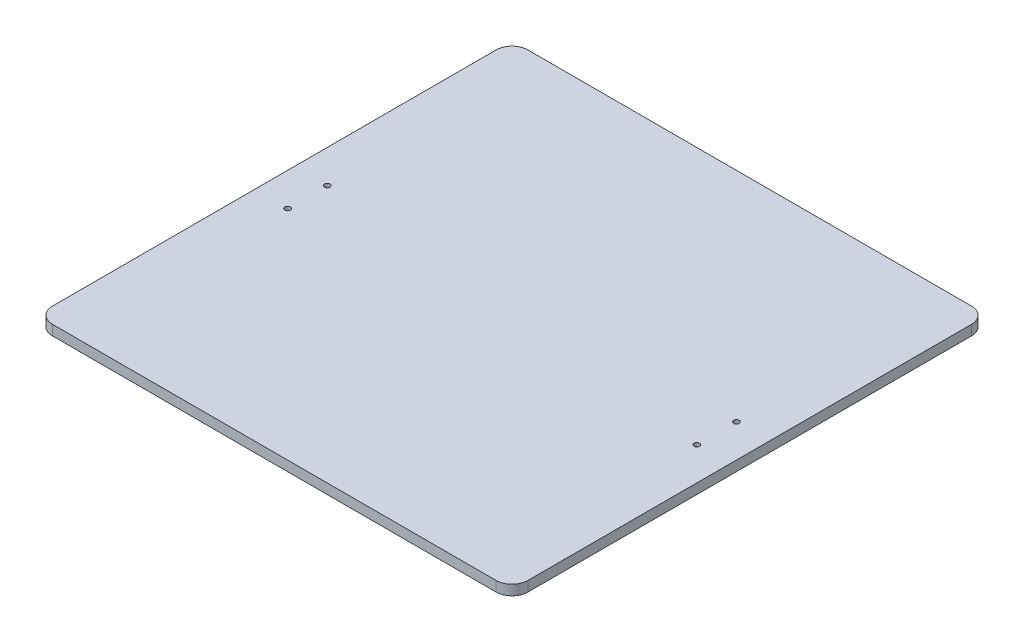
ISO-10303-21;
HEADER;
FILE_DESCRIPTION(('STEP AP214'),'2;1');
FILE_NAME('part.step','',(''),(''),'','','');
FILE_SCHEMA(('AUTOMOTIVE_DESIGN { 1 0 10303 214 1 1 1 1 }'));
ENDSEC;
DATA;
#1=APPLICATION_CONTEXT('core data for automotive mechanical design processes');
#2=APPLICATION_PROTOCOL_DEFINITION('international standard','automotive_design',2000,#1);
#3=PRODUCT_CONTEXT('',#1,'mechanical');
#4=PRODUCT('Part','Part','',(#3));
#5=PRODUCT_RELATED_PRODUCT_CATEGORY('part','',(#4));
#6=PRODUCT_DEFINITION_FORMATION('','',#4);
#7=PRODUCT_DEFINITION_CONTEXT('part definition',#1,'design');
#8=PRODUCT_DEFINITION('design','',#6,#7);
#9=PRODUCT_DEFINITION_SHAPE('','',#8);
#10=(LENGTH_UNIT() NAMED_UNIT(*) SI_UNIT(.MILLI.,.METRE.));
#11=(NAMED_UNIT(*) PLANE_ANGLE_UNIT() SI_UNIT($,.RADIAN.));
#12=(NAMED_UNIT(*) SI_UNIT($,.STERADIAN.) SOLID_ANGLE_UNIT());
#13=UNCERTAINTY_MEASURE_WITH_UNIT(LENGTH_MEASURE(1.E-05),#10,'distance_accuracy_value','');
#14=(GEOMETRIC_REPRESENTATION_CONTEXT(3) GLOBAL_UNCERTAINTY_ASSIGNED_CONTEXT((#13)) GLOBAL_UNIT_ASSIGNED_CONTEXT((#10,
#11,#12)) REPRESENTATION_CONTEXT('',''));
#15=CARTESIAN_POINT('',(0.,0.,0.));
#16=DIRECTION('',(0.,0.,1.));
#17=DIRECTION('',(1.,0.,0.));
#18=AXIS2_PLACEMENT_3D('',#15,#16,#17);
#19=CARTESIAN_POINT('',(150.,6.35,-150.));
#20=DIRECTION('',(-1.,0.,0.));
#21=DIRECTION('',(0.,0.,1.));
#22=AXIS2_PLACEMENT_3D('',#19,#20,#21);
#23=PLANE('',#22);
#24=DIRECTION('',(0.,0.,-1.));
#25=VECTOR('',#24,1.);
#26=CARTESIAN_POINT('',(150.,0.,-150.));
#27=LINE('',#26,#25);
#28=CARTESIAN_POINT('',(150.,0.,140.));
#29=VERTEX_POINT('',#28);
#30=CARTESIAN_POINT('',(150.,0.,-140.));
#31=VERTEX_POINT('',#30);
#32=EDGE_CURVE('E126',#29,#31,#27,.T.);
#33=ORIENTED_EDGE('',*,*,#32,.T.);
#34=DIRECTION('',(0.,-1.,0.));
#35=VECTOR('',#34,1.);
#36=CARTESIAN_POINT('',(150.,6.35,-140.));
#37=LINE('',#36,#35);
#38=CARTESIAN_POINT('',(150.,6.35,-140.));
#39=VERTEX_POINT('',#38);
#40=EDGE_CURVE('E104',#31,#39,#37,.F.);
#41=ORIENTED_EDGE('',*,*,#40,.T.);
#42=DIRECTION('',(0.,0.,-1.));
#43=VECTOR('',#42,1.);
#44=CARTESIAN_POINT('',(150.,6.35,-150.));
#45=LINE('',#44,#43);
#46=CARTESIAN_POINT('',(150.,6.35,140.));
#47=VERTEX_POINT('',#46);
#48=EDGE_CURVE('E136',#47,#39,#45,.T.);
#49=ORIENTED_EDGE('',*,*,#48,.F.);
#50=DIRECTION('',(0.,-1.,0.));
#51=VECTOR('',#50,1.);
#52=CARTESIAN_POINT('',(150.,6.35,140.));
#53=LINE('',#52,#51);
#54=EDGE_CURVE('E109',#47,#29,#53,.T.);
#55=ORIENTED_EDGE('',*,*,#54,.T.);
#56=EDGE_LOOP('',(#33,#41,#49,#55));
#57=FACE_BOUND('',#56,.T.);
#58=ADVANCED_FACE('F33',(#57),#23,.F.);
#59=CARTESIAN_POINT('',(-150.,6.35,-150.));
#60=DIRECTION('',(0.,0.,1.));
#61=DIRECTION('',(1.,0.,0.));
#62=AXIS2_PLACEMENT_3D('',#59,#60,#61);
#63=PLANE('',#62);
#64=DIRECTION('',(-1.,0.,0.));
#65=VECTOR('',#64,1.);
#66=CARTESIAN_POINT('',(-150.,6.35,-150.));
#67=LINE('',#66,#65);
#68=CARTESIAN_POINT('',(140.,6.35,-150.));
#69=VERTEX_POINT('',#68);
#70=CARTESIAN_POINT('',(-140.,6.35,-150.));
#71=VERTEX_POINT('',#70);
#72=EDGE_CURVE('E119',#69,#71,#67,.T.);
#73=ORIENTED_EDGE('',*,*,#72,.F.);
#74=DIRECTION('',(0.,-1.,0.));
#75=VECTOR('',#74,1.);
#76=CARTESIAN_POINT('',(140.,6.35,-150.));
#77=LINE('',#76,#75);
#78=CARTESIAN_POINT('',(140.,0.,-150.));
#79=VERTEX_POINT('',#78);
#80=EDGE_CURVE('E103',#69,#79,#77,.T.);
#81=ORIENTED_EDGE('',*,*,#80,.T.);
#82=DIRECTION('',(-1.,0.,0.));
#83=VECTOR('',#82,1.);
#84=CARTESIAN_POINT('',(-150.,0.,-150.));
#85=LINE('',#84,#83);
#86=CARTESIAN_POINT('',(-140.,0.,-150.));
#87=VERTEX_POINT('',#86);
#88=EDGE_CURVE('E116',#79,#87,#85,.T.);
#89=ORIENTED_EDGE('',*,*,#88,.T.);
#90=DIRECTION('',(0.,-1.,0.));
#91=VECTOR('',#90,1.);
#92=CARTESIAN_POINT('',(-140.,6.35,-150.));
#93=LINE('',#92,#91);
#94=EDGE_CURVE('E121',#87,#71,#93,.F.);
#95=ORIENTED_EDGE('',*,*,#94,.T.);
#96=EDGE_LOOP('',(#73,#81,#89,#95));
#97=FACE_BOUND('',#96,.T.);
#98=ADVANCED_FACE('F115',(#97),#63,.F.);
#99=CARTESIAN_POINT('',(-150.,6.35,-150.));
#100=DIRECTION('',(1.,0.,0.));
#101=DIRECTION('',(0.,0.,-1.));
#102=AXIS2_PLACEMENT_3D('',#99,#100,#101);
#103=PLANE('',#102);
#104=DIRECTION('',(0.,0.,1.));
#105=VECTOR('',#104,1.);
#106=CARTESIAN_POINT('',(-150.,0.,-150.));
#107=LINE('',#106,#105);
#108=CARTESIAN_POINT('',(-150.,0.,-140.));
#109=VERTEX_POINT('',#108);
#110=CARTESIAN_POINT('',(-150.,0.,140.));
#111=VERTEX_POINT('',#110);
#112=EDGE_CURVE('E125',#109,#111,#107,.T.);
#113=ORIENTED_EDGE('',*,*,#112,.T.);
#114=DIRECTION('',(0.,-1.,0.));
#115=VECTOR('',#114,1.);
#116=CARTESIAN_POINT('',(-150.,6.35,140.));
#117=LINE('',#116,#115);
#118=CARTESIAN_POINT('',(-150.,6.35,140.));
#119=VERTEX_POINT('',#118);
#120=EDGE_CURVE('E11',#111,#119,#117,.F.);
#121=ORIENTED_EDGE('',*,*,#120,.T.);
#122=DIRECTION('',(0.,0.,1.));
#123=VECTOR('',#122,1.);
#124=CARTESIAN_POINT('',(-150.,6.35,-150.));
#125=LINE('',#124,#123);
#126=CARTESIAN_POINT('',(-150.,6.35,-140.));
#127=VERTEX_POINT('',#126);
#128=EDGE_CURVE('E162',#127,#119,#125,.T.);
#129=ORIENTED_EDGE('',*,*,#128,.F.);
#130=DIRECTION('',(0.,-1.,0.));
#131=VECTOR('',#130,1.);
#132=CARTESIAN_POINT('',(-150.,6.35,-140.));
#133=LINE('',#132,#131);
#134=EDGE_CURVE('E41',#127,#109,#133,.T.);
#135=ORIENTED_EDGE('',*,*,#134,.T.);
#136=EDGE_LOOP('',(#113,#121,#129,#135));
#137=FACE_BOUND('',#136,.T.);
#138=ADVANCED_FACE('F160',(#137),#103,.F.);
#139=CARTESIAN_POINT('',(-150.,6.35,150.));
#140=DIRECTION('',(0.,0.,-1.));
#141=DIRECTION('',(-1.,0.,0.));
#142=AXIS2_PLACEMENT_3D('',#139,#140,#141);
#143=PLANE('',#142);
#144=DIRECTION('',(1.,0.,0.));
#145=VECTOR('',#144,1.);
#146=CARTESIAN_POINT('',(-150.,0.,150.));
#147=LINE('',#146,#145);
#148=CARTESIAN_POINT('',(-140.,0.,150.));
#149=VERTEX_POINT('',#148);
#150=CARTESIAN_POINT('',(140.,0.,150.));
#151=VERTEX_POINT('',#150);
#152=EDGE_CURVE('E129',#149,#151,#147,.T.);
#153=ORIENTED_EDGE('',*,*,#152,.T.);
#154=DIRECTION('',(0.,-1.,0.));
#155=VECTOR('',#154,1.);
#156=CARTESIAN_POINT('',(140.,6.35,150.));
#157=LINE('',#156,#155);
#158=CARTESIAN_POINT('',(140.,6.35,150.));
#159=VERTEX_POINT('',#158);
#160=EDGE_CURVE('E48',#151,#159,#157,.F.);
#161=ORIENTED_EDGE('',*,*,#160,.T.);
#162=DIRECTION('',(1.,0.,0.));
#163=VECTOR('',#162,1.);
#164=CARTESIAN_POINT('',(-150.,6.35,150.));
#165=LINE('',#164,#163);
#166=CARTESIAN_POINT('',(-140.,6.35,150.));
#167=VERTEX_POINT('',#166);
#168=EDGE_CURVE('E137',#167,#159,#165,.T.);
#169=ORIENTED_EDGE('',*,*,#168,.F.);
#170=DIRECTION('',(0.,-1.,0.));
#171=VECTOR('',#170,1.);
#172=CARTESIAN_POINT('',(-140.,6.35,150.));
#173=LINE('',#172,#171);
#174=EDGE_CURVE('E153',#167,#149,#173,.T.);
#175=ORIENTED_EDGE('',*,*,#174,.T.);
#176=EDGE_LOOP('',(#153,#161,#169,#175));
#177=FACE_BOUND('',#176,.T.);
#178=ADVANCED_FACE('F169',(#177),#143,.F.);
#179=CARTESIAN_POINT('',(0.,6.35,0.));
#180=DIRECTION('',(0.,1.,0.));
#181=DIRECTION('',(0.,0.,1.));
#182=AXIS2_PLACEMENT_3D('',#179,#180,#181);
#183=PLANE('',#182);
#184=CARTESIAN_POINT('',(129.12,6.35,12.5));
#185=DIRECTION('',(0.,1.,0.));
#186=DIRECTION('',(0.,0.,1.));
#187=AXIS2_PLACEMENT_3D('',#184,#185,#186);
#188=CIRCLE('',#187,1.75000000000001);
#189=CARTESIAN_POINT('',(129.12,6.35,14.2500000000001));
#190=VERTEX_POINT('',#189);
#191=EDGE_CURVE('E194',#190,#190,#188,.T.);
#192=ORIENTED_EDGE('',*,*,#191,.F.);
#193=EDGE_LOOP('',(#192));
#194=FACE_BOUND('',#193,.T.);
#195=CARTESIAN_POINT('',(129.12,6.35,-12.5));
#196=DIRECTION('',(0.,1.,0.));
#197=DIRECTION('',(0.,0.,1.));
#198=AXIS2_PLACEMENT_3D('',#195,#196,#197);
#199=CIRCLE('',#198,1.75000000000001);
#200=CARTESIAN_POINT('',(129.12,6.35,-10.7499999999999));
#201=VERTEX_POINT('',#200);
#202=EDGE_CURVE('E188',#201,#201,#199,.T.);
#203=ORIENTED_EDGE('',*,*,#202,.F.);
#204=EDGE_LOOP('',(#203));
#205=FACE_BOUND('',#204,.T.);
#206=CARTESIAN_POINT('',(-129.12,6.35,12.5));
#207=DIRECTION('',(0.,1.,0.));
#208=DIRECTION('',(0.,0.,1.));
#209=AXIS2_PLACEMENT_3D('',#206,#207,#208);
#210=CIRCLE('',#209,1.75000000000001);
#211=CARTESIAN_POINT('',(-129.12,6.35,14.2500000000001));
#212=VERTEX_POINT('',#211);
#213=EDGE_CURVE('E182',#212,#212,#210,.T.);
#214=ORIENTED_EDGE('',*,*,#213,.F.);
#215=EDGE_LOOP('',(#214));
#216=FACE_BOUND('',#215,.T.);
#217=CARTESIAN_POINT('',(-129.12,6.35,-12.5));
#218=DIRECTION('',(0.,1.,0.));
#219=DIRECTION('',(0.,0.,1.));
#220=AXIS2_PLACEMENT_3D('',#217,#218,#219);
#221=CIRCLE('',#220,1.75000000000001);
#222=CARTESIAN_POINT('',(-129.12,6.35,-10.7499999999999));
#223=VERTEX_POINT('',#222);
#224=EDGE_CURVE('E176',#223,#223,#221,.T.);
#225=ORIENTED_EDGE('',*,*,#224,.F.);
#226=EDGE_LOOP('',(#225));
#227=FACE_BOUND('',#226,.T.);
#228=ORIENTED_EDGE('',*,*,#48,.T.);
#229=CARTESIAN_POINT('',(140.,6.35,-140.));
#230=DIRECTION('',(0.,1.,0.));
#231=DIRECTION('',(0.,0.,1.));
#232=AXIS2_PLACEMENT_3D('',#229,#230,#231);
#233=CIRCLE('',#232,10.);
#234=EDGE_CURVE('E151',#39,#69,#233,.T.);
#235=ORIENTED_EDGE('',*,*,#234,.T.);
#236=ORIENTED_EDGE('',*,*,#72,.T.);
#237=CARTESIAN_POINT('',(-140.,6.35,-140.));
#238=DIRECTION('',(0.,1.,0.));
#239=DIRECTION('',(0.,0.,1.));
#240=AXIS2_PLACEMENT_3D('',#237,#238,#239);
#241=CIRCLE('',#240,10.);
#242=EDGE_CURVE('E146',#71,#127,#241,.T.);
#243=ORIENTED_EDGE('',*,*,#242,.T.);
#244=ORIENTED_EDGE('',*,*,#128,.T.);
#245=CARTESIAN_POINT('',(-140.,6.35,140.));
#246=DIRECTION('',(0.,1.,0.));
#247=DIRECTION('',(0.,0.,1.));
#248=AXIS2_PLACEMENT_3D('',#245,#246,#247);
#249=CIRCLE('',#248,10.);
#250=EDGE_CURVE('E55',#119,#167,#249,.T.);
#251=ORIENTED_EDGE('',*,*,#250,.T.);
#252=ORIENTED_EDGE('',*,*,#168,.T.);
#253=CARTESIAN_POINT('',(140.,6.35,140.));
#254=DIRECTION('',(0.,1.,0.));
#255=DIRECTION('',(0.,0.,1.));
#256=AXIS2_PLACEMENT_3D('',#253,#254,#255);
#257=CIRCLE('',#256,10.);
#258=EDGE_CURVE('E149',#159,#47,#257,.T.);
#259=ORIENTED_EDGE('',*,*,#258,.T.);
#260=EDGE_LOOP('',(#228,#235,#236,#243,#244,#251,#252,#259));
#261=FACE_BOUND('',#260,.T.);
#262=ADVANCED_FACE('F209',(#194,#205,#216,#227,#261),#183,.T.);
#263=CARTESIAN_POINT('',(0.,0.,0.));
#264=DIRECTION('',(0.,1.,0.));
#265=DIRECTION('',(0.,0.,1.));
#266=AXIS2_PLACEMENT_3D('',#263,#264,#265);
#267=PLANE('',#266);
#268=CARTESIAN_POINT('',(129.12,0.,12.5));
#269=DIRECTION('',(0.,1.,0.));
#270=DIRECTION('',(0.,0.,1.));
#271=AXIS2_PLACEMENT_3D('',#268,#269,#270);
#272=CIRCLE('',#271,1.75000000000001);
#273=CARTESIAN_POINT('',(129.12,0.,14.2500000000001));
#274=VERTEX_POINT('',#273);
#275=EDGE_CURVE('E191',#274,#274,#272,.T.);
#276=ORIENTED_EDGE('',*,*,#275,.T.);
#277=EDGE_LOOP('',(#276));
#278=FACE_BOUND('',#277,.T.);
#279=CARTESIAN_POINT('',(129.12,0.,-12.5));
#280=DIRECTION('',(0.,1.,0.));
#281=DIRECTION('',(0.,0.,1.));
#282=AXIS2_PLACEMENT_3D('',#279,#280,#281);
#283=CIRCLE('',#282,1.75000000000001);
#284=CARTESIAN_POINT('',(129.12,0.,-10.7499999999999));
#285=VERTEX_POINT('',#284);
#286=EDGE_CURVE('E185',#285,#285,#283,.T.);
#287=ORIENTED_EDGE('',*,*,#286,.T.);
#288=EDGE_LOOP('',(#287));
#289=FACE_BOUND('',#288,.T.);
#290=CARTESIAN_POINT('',(-129.12,0.,12.5));
#291=DIRECTION('',(0.,1.,0.));
#292=DIRECTION('',(0.,0.,1.));
#293=AXIS2_PLACEMENT_3D('',#290,#291,#292);
#294=CIRCLE('',#293,1.75000000000001);
#295=CARTESIAN_POINT('',(-129.12,0.,14.2500000000001));
#296=VERTEX_POINT('',#295);
#297=EDGE_CURVE('E179',#296,#296,#294,.T.);
#298=ORIENTED_EDGE('',*,*,#297,.T.);
#299=EDGE_LOOP('',(#298));
#300=FACE_BOUND('',#299,.T.);
#301=CARTESIAN_POINT('',(-129.12,0.,-12.5));
#302=DIRECTION('',(0.,1.,0.));
#303=DIRECTION('',(0.,0.,1.));
#304=AXIS2_PLACEMENT_3D('',#301,#302,#303);
#305=CIRCLE('',#304,1.75000000000001);
#306=CARTESIAN_POINT('',(-129.12,0.,-10.7499999999999));
#307=VERTEX_POINT('',#306);
#308=EDGE_CURVE('E131',#307,#307,#305,.T.);
#309=ORIENTED_EDGE('',*,*,#308,.T.);
#310=EDGE_LOOP('',(#309));
#311=FACE_BOUND('',#310,.T.);
#312=ORIENTED_EDGE('',*,*,#88,.F.);
#313=CARTESIAN_POINT('',(140.,0.,-140.));
#314=DIRECTION('',(0.,1.,0.));
#315=DIRECTION('',(0.,0.,1.));
#316=AXIS2_PLACEMENT_3D('',#313,#314,#315);
#317=CIRCLE('',#316,10.);
#318=EDGE_CURVE('E99',#79,#31,#317,.F.);
#319=ORIENTED_EDGE('',*,*,#318,.T.);
#320=ORIENTED_EDGE('',*,*,#32,.F.);
#321=CARTESIAN_POINT('',(140.,0.,140.));
#322=DIRECTION('',(0.,1.,0.));
#323=DIRECTION('',(0.,0.,1.));
#324=AXIS2_PLACEMENT_3D('',#321,#322,#323);
#325=CIRCLE('',#324,10.);
#326=EDGE_CURVE('E110',#29,#151,#325,.F.);
#327=ORIENTED_EDGE('',*,*,#326,.T.);
#328=ORIENTED_EDGE('',*,*,#152,.F.);
#329=CARTESIAN_POINT('',(-140.,0.,140.));
#330=DIRECTION('',(0.,1.,0.));
#331=DIRECTION('',(0.,0.,1.));
#332=AXIS2_PLACEMENT_3D('',#329,#330,#331);
#333=CIRCLE('',#332,10.);
#334=EDGE_CURVE('E140',#149,#111,#333,.F.);
#335=ORIENTED_EDGE('',*,*,#334,.T.);
#336=ORIENTED_EDGE('',*,*,#112,.F.);
#337=CARTESIAN_POINT('',(-140.,0.,-140.));
#338=DIRECTION('',(0.,1.,0.));
#339=DIRECTION('',(0.,0.,1.));
#340=AXIS2_PLACEMENT_3D('',#337,#338,#339);
#341=CIRCLE('',#340,10.);
#342=EDGE_CURVE('E120',#109,#87,#341,.F.);
#343=ORIENTED_EDGE('',*,*,#342,.T.);
#344=EDGE_LOOP('',(#312,#319,#320,#327,#328,#335,#336,#343));
#345=FACE_BOUND('',#344,.T.);
#346=ADVANCED_FACE('F123',(#278,#289,#300,#311,#345),#267,.F.);
#347=CARTESIAN_POINT('',(140.,6.35,-140.));
#348=DIRECTION('',(0.,-1.,0.));
#349=DIRECTION('',(0.,0.,-1.));
#350=AXIS2_PLACEMENT_3D('',#347,#348,#349);
#351=CYLINDRICAL_SURFACE('',#350,10.);
#352=ORIENTED_EDGE('',*,*,#234,.F.);
#353=ORIENTED_EDGE('',*,*,#40,.F.);
#354=ORIENTED_EDGE('',*,*,#318,.F.);
#355=ORIENTED_EDGE('',*,*,#80,.F.);
#356=EDGE_LOOP('',(#352,#353,#354,#355));
#357=FACE_BOUND('',#356,.T.);
#358=ADVANCED_FACE('F102',(#357),#351,.T.);
#359=CARTESIAN_POINT('',(140.,6.35,140.));
#360=DIRECTION('',(0.,-1.,0.));
#361=DIRECTION('',(0.,0.,-1.));
#362=AXIS2_PLACEMENT_3D('',#359,#360,#361);
#363=CYLINDRICAL_SURFACE('',#362,10.);
#364=ORIENTED_EDGE('',*,*,#258,.F.);
#365=ORIENTED_EDGE('',*,*,#160,.F.);
#366=ORIENTED_EDGE('',*,*,#326,.F.);
#367=ORIENTED_EDGE('',*,*,#54,.F.);
#368=EDGE_LOOP('',(#364,#365,#366,#367));
#369=FACE_BOUND('',#368,.T.);
#370=ADVANCED_FACE('F222',(#369),#363,.T.);
#371=CARTESIAN_POINT('',(-140.,6.35,140.));
#372=DIRECTION('',(0.,-1.,0.));
#373=DIRECTION('',(0.,0.,-1.));
#374=AXIS2_PLACEMENT_3D('',#371,#372,#373);
#375=CYLINDRICAL_SURFACE('',#374,10.);
#376=ORIENTED_EDGE('',*,*,#250,.F.);
#377=ORIENTED_EDGE('',*,*,#120,.F.);
#378=ORIENTED_EDGE('',*,*,#334,.F.);
#379=ORIENTED_EDGE('',*,*,#174,.F.);
#380=EDGE_LOOP('',(#376,#377,#378,#379));
#381=FACE_BOUND('',#380,.T.);
#382=ADVANCED_FACE('F168',(#381),#375,.T.);
#383=CARTESIAN_POINT('',(-140.,6.35,-140.));
#384=DIRECTION('',(0.,-1.,0.));
#385=DIRECTION('',(0.,0.,-1.));
#386=AXIS2_PLACEMENT_3D('',#383,#384,#385);
#387=CYLINDRICAL_SURFACE('',#386,10.);
#388=ORIENTED_EDGE('',*,*,#242,.F.);
#389=ORIENTED_EDGE('',*,*,#94,.F.);
#390=ORIENTED_EDGE('',*,*,#342,.F.);
#391=ORIENTED_EDGE('',*,*,#134,.F.);
#392=EDGE_LOOP('',(#388,#389,#390,#391));
#393=FACE_BOUND('',#392,.T.);
#394=ADVANCED_FACE('F35',(#393),#387,.T.);
#395=CARTESIAN_POINT('',(-129.12,0.,-12.5));
#396=DIRECTION('',(0.,1.,0.));
#397=DIRECTION('',(0.,0.,1.));
#398=AXIS2_PLACEMENT_3D('',#395,#396,#397);
#399=CYLINDRICAL_SURFACE('',#398,1.75000000000001);
#400=ORIENTED_EDGE('',*,*,#308,.F.);
#401=EDGE_LOOP('',(#400));
#402=FACE_BOUND('',#401,.T.);
#403=ORIENTED_EDGE('',*,*,#224,.T.);
#404=EDGE_LOOP('',(#403));
#405=FACE_BOUND('',#404,.T.);
#406=ADVANCED_FACE('F243',(#402,#405),#399,.F.);
#407=CARTESIAN_POINT('',(-129.12,0.,12.5));
#408=DIRECTION('',(0.,1.,0.));
#409=DIRECTION('',(0.,0.,1.));
#410=AXIS2_PLACEMENT_3D('',#407,#408,#409);
#411=CYLINDRICAL_SURFACE('',#410,1.75000000000001);
#412=ORIENTED_EDGE('',*,*,#297,.F.);
#413=EDGE_LOOP('',(#412));
#414=FACE_BOUND('',#413,.T.);
#415=ORIENTED_EDGE('',*,*,#213,.T.);
#416=EDGE_LOOP('',(#415));
#417=FACE_BOUND('',#416,.T.);
#418=ADVANCED_FACE('F246',(#414,#417),#411,.F.);
#419=CARTESIAN_POINT('',(129.12,0.,-12.5));
#420=DIRECTION('',(0.,1.,0.));
#421=DIRECTION('',(0.,0.,1.));
#422=AXIS2_PLACEMENT_3D('',#419,#420,#421);
#423=CYLINDRICAL_SURFACE('',#422,1.75000000000001);
#424=ORIENTED_EDGE('',*,*,#286,.F.);
#425=EDGE_LOOP('',(#424));
#426=FACE_BOUND('',#425,.T.);
#427=ORIENTED_EDGE('',*,*,#202,.T.);
#428=EDGE_LOOP('',(#427));
#429=FACE_BOUND('',#428,.T.);
#430=ADVANCED_FACE('F205',(#426,#429),#423,.F.);
#431=CARTESIAN_POINT('',(129.12,0.,12.5));
#432=DIRECTION('',(0.,1.,0.));
#433=DIRECTION('',(0.,0.,1.));
#434=AXIS2_PLACEMENT_3D('',#431,#432,#433);
#435=CYLINDRICAL_SURFACE('',#434,1.75000000000001);
#436=ORIENTED_EDGE('',*,*,#275,.F.);
#437=EDGE_LOOP('',(#436));
#438=FACE_BOUND('',#437,.T.);
#439=ORIENTED_EDGE('',*,*,#191,.T.);
#440=EDGE_LOOP('',(#439));
#441=FACE_BOUND('',#440,.T.);
#442=ADVANCED_FACE('F202',(#438,#441),#435,.F.);
#443=CLOSED_SHELL('',(#58,#98,#138,#178,#262,#346,#358,#370,#382,#394,#406,#418,#430,#442));
#444=MANIFOLD_SOLID_BREP('B2',#443);
#445=ADVANCED_BREP_SHAPE_REPRESENTATION('',(#18,#444),#14);
#446=SHAPE_DEFINITION_REPRESENTATION(#9,#445);
ENDSEC;
END-ISO-10303-21;
